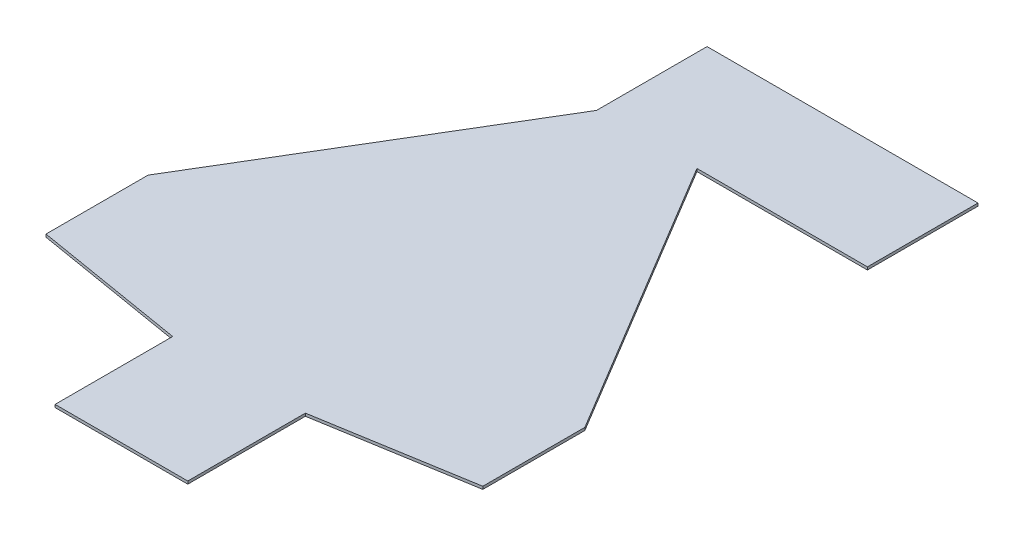
ISO-10303-21;
HEADER;
FILE_DESCRIPTION(('STEP AP214'),'2;1');
FILE_NAME('part.step','',(''),(''),'','','');
FILE_SCHEMA(('AUTOMOTIVE_DESIGN { 1 0 10303 214 1 1 1 1 }'));
ENDSEC;
DATA;
#1=APPLICATION_CONTEXT('core data for automotive mechanical design processes');
#2=APPLICATION_PROTOCOL_DEFINITION('international standard','automotive_design',2000,#1);
#3=PRODUCT_CONTEXT('',#1,'mechanical');
#4=PRODUCT('Part','Part','',(#3));
#5=PRODUCT_RELATED_PRODUCT_CATEGORY('part','',(#4));
#6=PRODUCT_DEFINITION_FORMATION('','',#4);
#7=PRODUCT_DEFINITION_CONTEXT('part definition',#1,'design');
#8=PRODUCT_DEFINITION('design','',#6,#7);
#9=PRODUCT_DEFINITION_SHAPE('','',#8);
#10=(LENGTH_UNIT() NAMED_UNIT(*) SI_UNIT(.MILLI.,.METRE.));
#11=(NAMED_UNIT(*) PLANE_ANGLE_UNIT() SI_UNIT($,.RADIAN.));
#12=(NAMED_UNIT(*) SI_UNIT($,.STERADIAN.) SOLID_ANGLE_UNIT());
#13=UNCERTAINTY_MEASURE_WITH_UNIT(LENGTH_MEASURE(1.E-05),#10,'distance_accuracy_value','');
#14=(GEOMETRIC_REPRESENTATION_CONTEXT(3) GLOBAL_UNCERTAINTY_ASSIGNED_CONTEXT((#13)) GLOBAL_UNIT_ASSIGNED_CONTEXT((#10,
#11,#12)) REPRESENTATION_CONTEXT('',''));
#15=CARTESIAN_POINT('',(0.,0.,0.));
#16=DIRECTION('',(0.,0.,1.));
#17=DIRECTION('',(1.,0.,0.));
#18=AXIS2_PLACEMENT_3D('',#15,#16,#17);
#19=CARTESIAN_POINT('',(-177.243029512937,2.54,0.));
#20=DIRECTION('',(1.,0.,0.));
#21=DIRECTION('',(0.,0.,-1.));
#22=AXIS2_PLACEMENT_3D('',#19,#20,#21);
#23=PLANE('',#22);
#24=DIRECTION('',(0.,0.,1.));
#25=VECTOR('',#24,1.);
#26=CARTESIAN_POINT('',(-177.243029512937,0.,0.));
#27=LINE('',#26,#25);
#28=CARTESIAN_POINT('',(-177.243029512937,0.,175.248335486113));
#29=VERTEX_POINT('',#28);
#30=CARTESIAN_POINT('',(-177.243029512937,0.,269.01335842602));
#31=VERTEX_POINT('',#30);
#32=EDGE_CURVE('E159',#29,#31,#27,.T.);
#33=ORIENTED_EDGE('',*,*,#32,.T.);
#34=DIRECTION('',(0.,-1.,0.));
#35=VECTOR('',#34,1.);
#36=CARTESIAN_POINT('',(-177.243029512937,2.54,269.01335842602));
#37=LINE('',#36,#35);
#38=CARTESIAN_POINT('',(-177.243029512937,2.54,269.01335842602));
#39=VERTEX_POINT('',#38);
#40=EDGE_CURVE('E11',#39,#31,#37,.T.);
#41=ORIENTED_EDGE('',*,*,#40,.F.);
#42=DIRECTION('',(0.,0.,1.));
#43=VECTOR('',#42,1.);
#44=CARTESIAN_POINT('',(-177.243029512937,2.54,0.));
#45=LINE('',#44,#43);
#46=CARTESIAN_POINT('',(-177.243029512937,2.54,175.248335486113));
#47=VERTEX_POINT('',#46);
#48=EDGE_CURVE('E190',#47,#39,#45,.T.);
#49=ORIENTED_EDGE('',*,*,#48,.F.);
#50=DIRECTION('',(0.,-1.,0.));
#51=VECTOR('',#50,1.);
#52=CARTESIAN_POINT('',(-177.243029512937,2.54,175.248335486113));
#53=LINE('',#52,#51);
#54=EDGE_CURVE('E155',#47,#29,#53,.T.);
#55=ORIENTED_EDGE('',*,*,#54,.T.);
#56=EDGE_LOOP('',(#33,#41,#49,#55));
#57=FACE_BOUND('',#56,.T.);
#58=ADVANCED_FACE('F34',(#57),#23,.F.);
#59=CARTESIAN_POINT('',(-48.5264604151236,2.54,290.513750360465));
#60=DIRECTION('',(0.164754096556375,0.,-0.986334673256442));
#61=DIRECTION('',(-0.986334673256442,0.,-0.164754096556375));
#62=AXIS2_PLACEMENT_3D('',#59,#60,#61);
#63=PLANE('',#62);
#64=DIRECTION('',(0.986334673256442,0.,0.164754096556375));
#65=VECTOR('',#64,1.);
#66=CARTESIAN_POINT('',(-48.5264604151236,0.,290.513750360465));
#67=LINE('',#66,#65);
#68=CARTESIAN_POINT('',(-37.5430295129392,0.,292.34838649812));
#69=VERTEX_POINT('',#68);
#70=EDGE_CURVE('E162',#31,#69,#67,.T.);
#71=ORIENTED_EDGE('',*,*,#70,.T.);
#72=DIRECTION('',(0.,-1.,0.));
#73=VECTOR('',#72,1.);
#74=CARTESIAN_POINT('',(-37.5430295129392,2.54,292.34838649812));
#75=LINE('',#74,#73);
#76=CARTESIAN_POINT('',(-37.5430295129392,2.54,292.34838649812));
#77=VERTEX_POINT('',#76);
#78=EDGE_CURVE('E42',#77,#69,#75,.T.);
#79=ORIENTED_EDGE('',*,*,#78,.F.);
#80=DIRECTION('',(0.986334673256442,0.,0.164754096556375));
#81=VECTOR('',#80,1.);
#82=CARTESIAN_POINT('',(-48.5264604151236,2.54,290.513750360465));
#83=LINE('',#82,#81);
#84=EDGE_CURVE('E104',#39,#77,#83,.T.);
#85=ORIENTED_EDGE('',*,*,#84,.F.);
#86=ORIENTED_EDGE('',*,*,#40,.T.);
#87=EDGE_LOOP('',(#71,#79,#85,#86));
#88=FACE_BOUND('',#87,.T.);
#89=ADVANCED_FACE('F265',(#88),#63,.F.);
#90=CARTESIAN_POINT('',(-37.5430295129393,2.54,0.));
#91=DIRECTION('',(1.,0.,0.));
#92=DIRECTION('',(0.,0.,-1.));
#93=AXIS2_PLACEMENT_3D('',#90,#91,#92);
#94=PLANE('',#93);
#95=DIRECTION('',(0.,0.,1.));
#96=VECTOR('',#95,1.);
#97=CARTESIAN_POINT('',(-37.5430295129393,0.,0.));
#98=LINE('',#97,#96);
#99=CARTESIAN_POINT('',(-37.5430295129392,0.,400.386363558214));
#100=VERTEX_POINT('',#99);
#101=EDGE_CURVE('E164',#69,#100,#98,.T.);
#102=ORIENTED_EDGE('',*,*,#101,.T.);
#103=DIRECTION('',(0.,-1.,0.));
#104=VECTOR('',#103,1.);
#105=CARTESIAN_POINT('',(-37.5430295129392,2.54,400.386363558214));
#106=LINE('',#105,#104);
#107=CARTESIAN_POINT('',(-37.5430295129392,2.54,400.386363558214));
#108=VERTEX_POINT('',#107);
#109=EDGE_CURVE('E207',#108,#100,#106,.T.);
#110=ORIENTED_EDGE('',*,*,#109,.F.);
#111=DIRECTION('',(0.,0.,1.));
#112=VECTOR('',#111,1.);
#113=CARTESIAN_POINT('',(-37.5430295129393,2.54,0.));
#114=LINE('',#113,#112);
#115=EDGE_CURVE('E215',#77,#108,#114,.T.);
#116=ORIENTED_EDGE('',*,*,#115,.F.);
#117=ORIENTED_EDGE('',*,*,#78,.T.);
#118=EDGE_LOOP('',(#102,#110,#116,#117));
#119=FACE_BOUND('',#118,.T.);
#120=ADVANCED_FACE('F213',(#119),#94,.F.);
#121=CARTESIAN_POINT('',(0.,2.54,400.386363558214));
#122=DIRECTION('',(0.,0.,-1.));
#123=DIRECTION('',(-1.,0.,0.));
#124=AXIS2_PLACEMENT_3D('',#121,#122,#123);
#125=PLANE('',#124);
#126=DIRECTION('',(1.,0.,0.));
#127=VECTOR('',#126,1.);
#128=CARTESIAN_POINT('',(0.,0.,400.386363558214));
#129=LINE('',#128,#127);
#130=CARTESIAN_POINT('',(84.3769704870607,0.,400.386363558214));
#131=VERTEX_POINT('',#130);
#132=EDGE_CURVE('E166',#100,#131,#129,.T.);
#133=ORIENTED_EDGE('',*,*,#132,.T.);
#134=DIRECTION('',(0.,-1.,0.));
#135=VECTOR('',#134,1.);
#136=CARTESIAN_POINT('',(84.3769704870607,2.54,400.386363558214));
#137=LINE('',#136,#135);
#138=CARTESIAN_POINT('',(84.3769704870607,2.54,400.386363558214));
#139=VERTEX_POINT('',#138);
#140=EDGE_CURVE('E204',#139,#131,#137,.T.);
#141=ORIENTED_EDGE('',*,*,#140,.F.);
#142=DIRECTION('',(1.,0.,0.));
#143=VECTOR('',#142,1.);
#144=CARTESIAN_POINT('',(0.,2.54,400.386363558214));
#145=LINE('',#144,#143);
#146=EDGE_CURVE('E233',#108,#139,#145,.T.);
#147=ORIENTED_EDGE('',*,*,#146,.F.);
#148=ORIENTED_EDGE('',*,*,#109,.T.);
#149=EDGE_LOOP('',(#133,#141,#147,#148));
#150=FACE_BOUND('',#149,.T.);
#151=ADVANCED_FACE('F223',(#150),#125,.F.);
#152=CARTESIAN_POINT('',(84.3769704870607,2.54,0.));
#153=DIRECTION('',(-1.,0.,0.));
#154=DIRECTION('',(0.,0.,1.));
#155=AXIS2_PLACEMENT_3D('',#152,#153,#154);
#156=PLANE('',#155);
#157=DIRECTION('',(0.,0.,-1.));
#158=VECTOR('',#157,1.);
#159=CARTESIAN_POINT('',(84.3769704870607,0.,0.));
#160=LINE('',#159,#158);
#161=CARTESIAN_POINT('',(84.3769704870607,0.,292.34838649812));
#162=VERTEX_POINT('',#161);
#163=EDGE_CURVE('E168',#131,#162,#160,.T.);
#164=ORIENTED_EDGE('',*,*,#163,.T.);
#165=DIRECTION('',(0.,-1.,0.));
#166=VECTOR('',#165,1.);
#167=CARTESIAN_POINT('',(84.3769704870607,2.54,292.34838649812));
#168=LINE('',#167,#166);
#169=CARTESIAN_POINT('',(84.3769704870607,2.54,292.34838649812));
#170=VERTEX_POINT('',#169);
#171=EDGE_CURVE('E202',#170,#162,#168,.T.);
#172=ORIENTED_EDGE('',*,*,#171,.F.);
#173=DIRECTION('',(0.,0.,-1.));
#174=VECTOR('',#173,1.);
#175=CARTESIAN_POINT('',(84.3769704870607,2.54,0.));
#176=LINE('',#175,#174);
#177=EDGE_CURVE('E229',#139,#170,#176,.T.);
#178=ORIENTED_EDGE('',*,*,#177,.F.);
#179=ORIENTED_EDGE('',*,*,#140,.T.);
#180=EDGE_LOOP('',(#164,#172,#178,#179));
#181=FACE_BOUND('',#180,.T.);
#182=ADVANCED_FACE('F227',(#181),#156,.F.);
#183=CARTESIAN_POINT('',(49.797716803062,2.54,298.124391189802));
#184=DIRECTION('',(0.164754096556277,0.,0.986334673256459));
#185=DIRECTION('',(0.986334673256459,0.,-0.164754096556277));
#186=AXIS2_PLACEMENT_3D('',#183,#184,#185);
#187=PLANE('',#186);
#188=DIRECTION('',(-0.986334673256459,0.,0.164754096556277));
#189=VECTOR('',#188,1.);
#190=CARTESIAN_POINT('',(49.797716803062,0.,298.124391189802));
#191=LINE('',#190,#189);
#192=CARTESIAN_POINT('',(224.076970487061,0.,269.013358426034));
#193=VERTEX_POINT('',#192);
#194=EDGE_CURVE('E171',#193,#162,#191,.T.);
#195=ORIENTED_EDGE('',*,*,#194,.F.);
#196=DIRECTION('',(0.,-1.,0.));
#197=VECTOR('',#196,1.);
#198=CARTESIAN_POINT('',(224.076970487061,2.54,269.013358426034));
#199=LINE('',#198,#197);
#200=CARTESIAN_POINT('',(224.076970487061,2.54,269.013358426034));
#201=VERTEX_POINT('',#200);
#202=EDGE_CURVE('E200',#201,#193,#199,.T.);
#203=ORIENTED_EDGE('',*,*,#202,.F.);
#204=DIRECTION('',(-0.986334673256459,0.,0.164754096556277));
#205=VECTOR('',#204,1.);
#206=CARTESIAN_POINT('',(49.797716803062,2.54,298.124391189802));
#207=LINE('',#206,#205);
#208=EDGE_CURVE('E232',#201,#170,#207,.T.);
#209=ORIENTED_EDGE('',*,*,#208,.T.);
#210=ORIENTED_EDGE('',*,*,#171,.T.);
#211=EDGE_LOOP('',(#195,#203,#209,#210));
#212=FACE_BOUND('',#211,.T.);
#213=ADVANCED_FACE('F278',(#212),#187,.T.);
#214=CARTESIAN_POINT('',(224.076970487061,2.54,0.));
#215=DIRECTION('',(1.,0.,0.));
#216=DIRECTION('',(0.,0.,-1.));
#217=AXIS2_PLACEMENT_3D('',#214,#215,#216);
#218=PLANE('',#217);
#219=DIRECTION('',(0.,0.,1.));
#220=VECTOR('',#219,1.);
#221=CARTESIAN_POINT('',(224.076970487061,0.,0.));
#222=LINE('',#221,#220);
#223=CARTESIAN_POINT('',(224.076970487061,0.,175.248335486128));
#224=VERTEX_POINT('',#223);
#225=EDGE_CURVE('E174',#224,#193,#222,.T.);
#226=ORIENTED_EDGE('',*,*,#225,.F.);
#227=DIRECTION('',(0.,-1.,0.));
#228=VECTOR('',#227,1.);
#229=CARTESIAN_POINT('',(224.076970487061,2.54,175.248335486128));
#230=LINE('',#229,#228);
#231=CARTESIAN_POINT('',(224.076970487061,2.54,175.248335486128));
#232=VERTEX_POINT('',#231);
#233=EDGE_CURVE('E198',#232,#224,#230,.T.);
#234=ORIENTED_EDGE('',*,*,#233,.F.);
#235=DIRECTION('',(0.,0.,1.));
#236=VECTOR('',#235,1.);
#237=CARTESIAN_POINT('',(224.076970487061,2.54,0.));
#238=LINE('',#237,#236);
#239=EDGE_CURVE('E235',#232,#201,#238,.T.);
#240=ORIENTED_EDGE('',*,*,#239,.T.);
#241=ORIENTED_EDGE('',*,*,#202,.T.);
#242=EDGE_LOOP('',(#226,#234,#240,#241));
#243=FACE_BOUND('',#242,.T.);
#244=ADVANCED_FACE('F281',(#243),#218,.T.);
#245=CARTESIAN_POINT('',(87.4195874906451,2.54,-52.4634006624244));
#246=DIRECTION('',(0.857442517454998,0.,-0.514579759862779));
#247=DIRECTION('',(-0.514579759862779,0.,-0.857442517454998));
#248=AXIS2_PLACEMENT_3D('',#245,#246,#247);
#249=PLANE('',#248);
#250=DIRECTION('',(0.514579759862779,0.,0.857442517454998));
#251=VECTOR('',#250,1.);
#252=CARTESIAN_POINT('',(87.4195874906451,0.,-52.4634006624244));
#253=LINE('',#252,#251);
#254=CARTESIAN_POINT('',(69.5654819715443,0.,-82.213636441786));
#255=VERTEX_POINT('',#254);
#256=EDGE_CURVE('E177',#255,#224,#253,.T.);
#257=ORIENTED_EDGE('',*,*,#256,.F.);
#258=DIRECTION('',(0.,-1.,0.));
#259=VECTOR('',#258,1.);
#260=CARTESIAN_POINT('',(69.5654819715443,2.54,-82.213636441786));
#261=LINE('',#260,#259);
#262=CARTESIAN_POINT('',(69.5654819715443,2.54,-82.213636441786));
#263=VERTEX_POINT('',#262);
#264=EDGE_CURVE('E196',#263,#255,#261,.T.);
#265=ORIENTED_EDGE('',*,*,#264,.F.);
#266=DIRECTION('',(0.514579759862779,0.,0.857442517454998));
#267=VECTOR('',#266,1.);
#268=CARTESIAN_POINT('',(87.4195874906451,2.54,-52.4634006624244));
#269=LINE('',#268,#267);
#270=EDGE_CURVE('E242',#263,#232,#269,.T.);
#271=ORIENTED_EDGE('',*,*,#270,.T.);
#272=ORIENTED_EDGE('',*,*,#233,.T.);
#273=EDGE_LOOP('',(#257,#265,#271,#272));
#274=FACE_BOUND('',#273,.T.);
#275=ADVANCED_FACE('F285',(#274),#249,.T.);
#276=CARTESIAN_POINT('',(0.,2.54,-82.213636441786));
#277=DIRECTION('',(0.,0.,1.));
#278=DIRECTION('',(1.,0.,0.));
#279=AXIS2_PLACEMENT_3D('',#276,#277,#278);
#280=PLANE('',#279);
#281=DIRECTION('',(-1.,0.,0.));
#282=VECTOR('',#281,1.);
#283=CARTESIAN_POINT('',(0.,0.,-82.213636441786));
#284=LINE('',#283,#282);
#285=CARTESIAN_POINT('',(226.188459002577,0.,-82.213636441786));
#286=VERTEX_POINT('',#285);
#287=EDGE_CURVE('E180',#286,#255,#284,.T.);
#288=ORIENTED_EDGE('',*,*,#287,.F.);
#289=DIRECTION('',(0.,-1.,0.));
#290=VECTOR('',#289,1.);
#291=CARTESIAN_POINT('',(226.188459002577,2.54,-82.213636441786));
#292=LINE('',#291,#290);
#293=CARTESIAN_POINT('',(226.188459002577,2.54,-82.213636441786));
#294=VERTEX_POINT('',#293);
#295=EDGE_CURVE('E194',#294,#286,#292,.T.);
#296=ORIENTED_EDGE('',*,*,#295,.F.);
#297=DIRECTION('',(-1.,0.,0.));
#298=VECTOR('',#297,1.);
#299=CARTESIAN_POINT('',(0.,2.54,-82.213636441786));
#300=LINE('',#299,#298);
#301=EDGE_CURVE('E245',#294,#263,#300,.T.);
#302=ORIENTED_EDGE('',*,*,#301,.T.);
#303=ORIENTED_EDGE('',*,*,#264,.T.);
#304=EDGE_LOOP('',(#288,#296,#302,#303));
#305=FACE_BOUND('',#304,.T.);
#306=ADVANCED_FACE('F289',(#305),#280,.T.);
#307=CARTESIAN_POINT('',(226.188459002577,2.54,0.));
#308=DIRECTION('',(1.,0.,0.));
#309=DIRECTION('',(0.,0.,-1.));
#310=AXIS2_PLACEMENT_3D('',#307,#308,#309);
#311=PLANE('',#310);
#312=DIRECTION('',(0.,0.,1.));
#313=VECTOR('',#312,1.);
#314=CARTESIAN_POINT('',(226.188459002577,0.,0.));
#315=LINE('',#314,#313);
#316=CARTESIAN_POINT('',(226.188459002577,0.,-183.813636441786));
#317=VERTEX_POINT('',#316);
#318=EDGE_CURVE('E183',#317,#286,#315,.T.);
#319=ORIENTED_EDGE('',*,*,#318,.F.);
#320=DIRECTION('',(0.,-1.,0.));
#321=VECTOR('',#320,1.);
#322=CARTESIAN_POINT('',(226.188459002577,2.54,-183.813636441786));
#323=LINE('',#322,#321);
#324=CARTESIAN_POINT('',(226.188459002577,2.54,-183.813636441786));
#325=VERTEX_POINT('',#324);
#326=EDGE_CURVE('E144',#325,#317,#323,.T.);
#327=ORIENTED_EDGE('',*,*,#326,.F.);
#328=DIRECTION('',(0.,0.,1.));
#329=VECTOR('',#328,1.);
#330=CARTESIAN_POINT('',(226.188459002577,2.54,0.));
#331=LINE('',#330,#329);
#332=EDGE_CURVE('E151',#325,#294,#331,.T.);
#333=ORIENTED_EDGE('',*,*,#332,.T.);
#334=ORIENTED_EDGE('',*,*,#295,.T.);
#335=EDGE_LOOP('',(#319,#327,#333,#334));
#336=FACE_BOUND('',#335,.T.);
#337=ADVANCED_FACE('F249',(#336),#311,.T.);
#338=CARTESIAN_POINT('',(0.,2.54,-183.813636441786));
#339=DIRECTION('',(0.,0.,-1.));
#340=DIRECTION('',(-1.,0.,0.));
#341=AXIS2_PLACEMENT_3D('',#338,#339,#340);
#342=PLANE('',#341);
#343=DIRECTION('',(1.,0.,0.));
#344=VECTOR('',#343,1.);
#345=CARTESIAN_POINT('',(0.,0.,-183.813636441786));
#346=LINE('',#345,#344);
#347=CARTESIAN_POINT('',(-22.7315409974229,0.,-183.813636441786));
#348=VERTEX_POINT('',#347);
#349=EDGE_CURVE('E139',#348,#317,#346,.T.);
#350=ORIENTED_EDGE('',*,*,#349,.F.);
#351=DIRECTION('',(0.,-1.,0.));
#352=VECTOR('',#351,1.);
#353=CARTESIAN_POINT('',(-22.7315409974229,2.54,-183.813636441786));
#354=LINE('',#353,#352);
#355=CARTESIAN_POINT('',(-22.7315409974229,2.54,-183.813636441786));
#356=VERTEX_POINT('',#355);
#357=EDGE_CURVE('E134',#356,#348,#354,.T.);
#358=ORIENTED_EDGE('',*,*,#357,.F.);
#359=DIRECTION('',(1.,0.,0.));
#360=VECTOR('',#359,1.);
#361=CARTESIAN_POINT('',(0.,2.54,-183.813636441786));
#362=LINE('',#361,#360);
#363=EDGE_CURVE('E137',#356,#325,#362,.T.);
#364=ORIENTED_EDGE('',*,*,#363,.T.);
#365=ORIENTED_EDGE('',*,*,#326,.T.);
#366=EDGE_LOOP('',(#350,#358,#364,#365));
#367=FACE_BOUND('',#366,.T.);
#368=ADVANCED_FACE('F136',(#367),#342,.T.);
#369=CARTESIAN_POINT('',(-22.7315409974229,2.54,0.));
#370=DIRECTION('',(-1.,0.,0.));
#371=DIRECTION('',(0.,0.,1.));
#372=AXIS2_PLACEMENT_3D('',#369,#370,#371);
#373=PLANE('',#372);
#374=DIRECTION('',(0.,0.,-1.));
#375=VECTOR('',#374,1.);
#376=CARTESIAN_POINT('',(-22.7315409974229,0.,0.));
#377=LINE('',#376,#375);
#378=CARTESIAN_POINT('',(-22.7315409974229,0.,-82.213636441786));
#379=VERTEX_POINT('',#378);
#380=EDGE_CURVE('E187',#379,#348,#377,.T.);
#381=ORIENTED_EDGE('',*,*,#380,.F.);
#382=DIRECTION('',(0.,-1.,0.));
#383=VECTOR('',#382,1.);
#384=CARTESIAN_POINT('',(-22.7315409974229,2.54,-82.213636441786));
#385=LINE('',#384,#383);
#386=CARTESIAN_POINT('',(-22.7315409974229,2.54,-82.213636441786));
#387=VERTEX_POINT('',#386);
#388=EDGE_CURVE('E93',#387,#379,#385,.T.);
#389=ORIENTED_EDGE('',*,*,#388,.F.);
#390=DIRECTION('',(0.,0.,-1.));
#391=VECTOR('',#390,1.);
#392=CARTESIAN_POINT('',(-22.7315409974229,2.54,0.));
#393=LINE('',#392,#391);
#394=EDGE_CURVE('E148',#387,#356,#393,.T.);
#395=ORIENTED_EDGE('',*,*,#394,.T.);
#396=ORIENTED_EDGE('',*,*,#357,.T.);
#397=EDGE_LOOP('',(#381,#389,#395,#396));
#398=FACE_BOUND('',#397,.T.);
#399=ADVANCED_FACE('F153',(#398),#373,.T.);
#400=CARTESIAN_POINT('',(-52.9869148355074,2.54,-31.7992091094982));
#401=DIRECTION('',(0.857442517454988,0.,0.514579759862795));
#402=DIRECTION('',(0.514579759862795,0.,-0.857442517454988));
#403=AXIS2_PLACEMENT_3D('',#400,#401,#402);
#404=PLANE('',#403);
#405=DIRECTION('',(-0.514579759862795,0.,0.857442517454988));
#406=VECTOR('',#405,1.);
#407=CARTESIAN_POINT('',(-52.9869148355074,0.,-31.7992091094982));
#408=LINE('',#407,#406);
#409=EDGE_CURVE('E96',#379,#29,#408,.T.);
#410=ORIENTED_EDGE('',*,*,#409,.T.);
#411=ORIENTED_EDGE('',*,*,#54,.F.);
#412=DIRECTION('',(-0.514579759862795,0.,0.857442517454988));
#413=VECTOR('',#412,1.);
#414=CARTESIAN_POINT('',(-52.9869148355074,2.54,-31.7992091094982));
#415=LINE('',#414,#413);
#416=EDGE_CURVE('E50',#387,#47,#415,.T.);
#417=ORIENTED_EDGE('',*,*,#416,.F.);
#418=ORIENTED_EDGE('',*,*,#388,.T.);
#419=EDGE_LOOP('',(#410,#411,#417,#418));
#420=FACE_BOUND('',#419,.T.);
#421=ADVANCED_FACE('F254',(#420),#404,.F.);
#422=CARTESIAN_POINT('',(0.,2.54,0.));
#423=DIRECTION('',(0.,1.,0.));
#424=DIRECTION('',(0.,0.,1.));
#425=AXIS2_PLACEMENT_3D('',#422,#423,#424);
#426=PLANE('',#425);
#427=ORIENTED_EDGE('',*,*,#48,.T.);
#428=ORIENTED_EDGE('',*,*,#84,.T.);
#429=ORIENTED_EDGE('',*,*,#115,.T.);
#430=ORIENTED_EDGE('',*,*,#146,.T.);
#431=ORIENTED_EDGE('',*,*,#177,.T.);
#432=ORIENTED_EDGE('',*,*,#208,.F.);
#433=ORIENTED_EDGE('',*,*,#239,.F.);
#434=ORIENTED_EDGE('',*,*,#270,.F.);
#435=ORIENTED_EDGE('',*,*,#301,.F.);
#436=ORIENTED_EDGE('',*,*,#332,.F.);
#437=ORIENTED_EDGE('',*,*,#363,.F.);
#438=ORIENTED_EDGE('',*,*,#394,.F.);
#439=ORIENTED_EDGE('',*,*,#416,.T.);
#440=EDGE_LOOP('',(#427,#428,#429,#430,#431,#432,#433,#434,#435,#436,#437,#438,#439));
#441=FACE_BOUND('',#440,.T.);
#442=ADVANCED_FACE('F147',(#441),#426,.T.);
#443=CARTESIAN_POINT('',(0.,0.,0.));
#444=DIRECTION('',(0.,1.,0.));
#445=DIRECTION('',(0.,0.,1.));
#446=AXIS2_PLACEMENT_3D('',#443,#444,#445);
#447=PLANE('',#446);
#448=ORIENTED_EDGE('',*,*,#32,.F.);
#449=ORIENTED_EDGE('',*,*,#409,.F.);
#450=ORIENTED_EDGE('',*,*,#380,.T.);
#451=ORIENTED_EDGE('',*,*,#349,.T.);
#452=ORIENTED_EDGE('',*,*,#318,.T.);
#453=ORIENTED_EDGE('',*,*,#287,.T.);
#454=ORIENTED_EDGE('',*,*,#256,.T.);
#455=ORIENTED_EDGE('',*,*,#225,.T.);
#456=ORIENTED_EDGE('',*,*,#194,.T.);
#457=ORIENTED_EDGE('',*,*,#163,.F.);
#458=ORIENTED_EDGE('',*,*,#132,.F.);
#459=ORIENTED_EDGE('',*,*,#101,.F.);
#460=ORIENTED_EDGE('',*,*,#70,.F.);
#461=EDGE_LOOP('',(#448,#449,#450,#451,#452,#453,#454,#455,#456,#457,#458,#459,#460));
#462=FACE_BOUND('',#461,.T.);
#463=ADVANCED_FACE('F219',(#462),#447,.F.);
#464=CLOSED_SHELL('',(#58,#89,#120,#151,#182,#213,#244,#275,#306,#337,#368,#399,#421,#442,#463));
#465=MANIFOLD_SOLID_BREP('B2',#464);
#466=ADVANCED_BREP_SHAPE_REPRESENTATION('',(#18,#465),#14);
#467=SHAPE_DEFINITION_REPRESENTATION(#9,#466);
ENDSEC;
END-ISO-10303-21;
